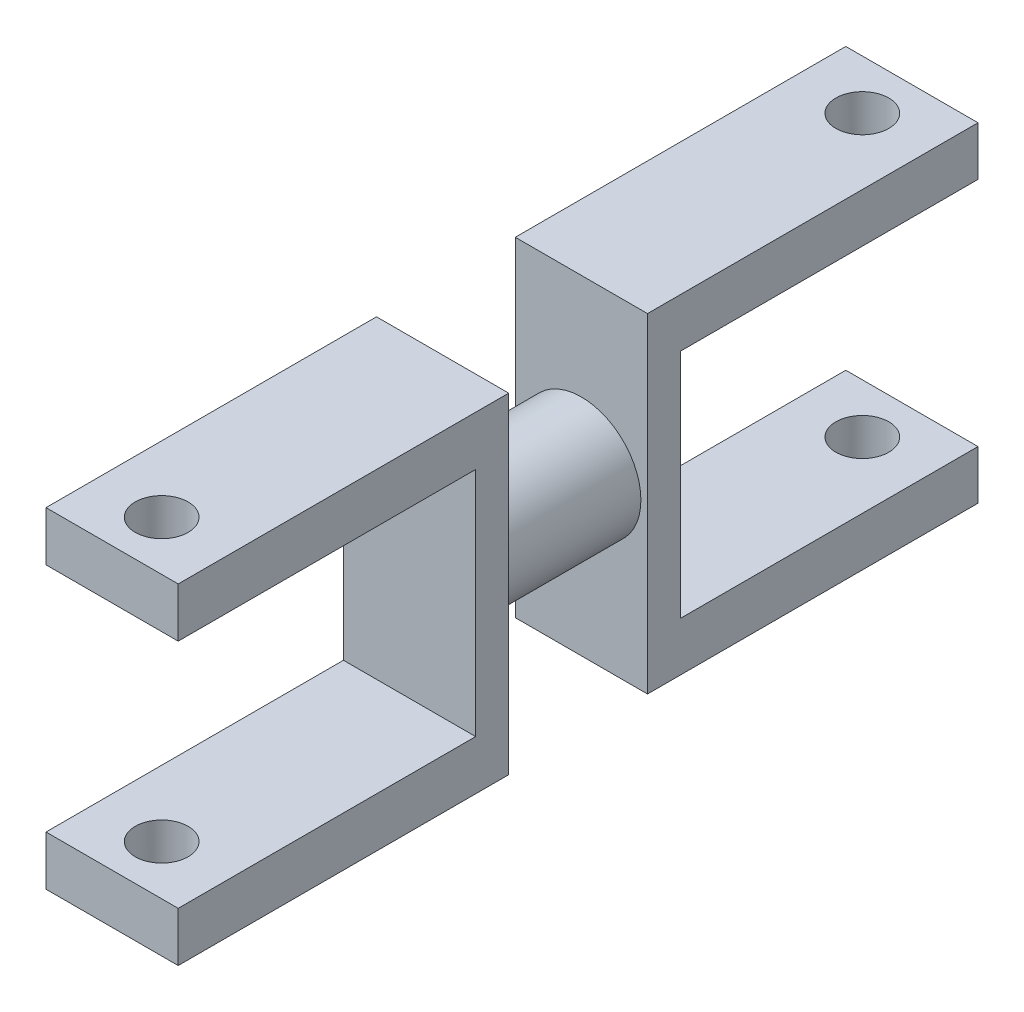
ISO-10303-21;
HEADER;
FILE_DESCRIPTION(('STEP AP214'),'2;1');
FILE_NAME('part.step','',(''),(''),'','','');
FILE_SCHEMA(('AUTOMOTIVE_DESIGN { 1 0 10303 214 1 1 1 1 }'));
ENDSEC;
DATA;
#1=APPLICATION_CONTEXT('core data for automotive mechanical design processes');
#2=APPLICATION_PROTOCOL_DEFINITION('international standard','automotive_design',2000,#1);
#3=PRODUCT_CONTEXT('',#1,'mechanical');
#4=PRODUCT('Part','Part','',(#3));
#5=PRODUCT_RELATED_PRODUCT_CATEGORY('part','',(#4));
#6=PRODUCT_DEFINITION_FORMATION('','',#4);
#7=PRODUCT_DEFINITION_CONTEXT('part definition',#1,'design');
#8=PRODUCT_DEFINITION('design','',#6,#7);
#9=PRODUCT_DEFINITION_SHAPE('','',#8);
#10=(LENGTH_UNIT() NAMED_UNIT(*) SI_UNIT(.MILLI.,.METRE.));
#11=(NAMED_UNIT(*) PLANE_ANGLE_UNIT() SI_UNIT($,.RADIAN.));
#12=(NAMED_UNIT(*) SI_UNIT($,.STERADIAN.) SOLID_ANGLE_UNIT());
#13=UNCERTAINTY_MEASURE_WITH_UNIT(LENGTH_MEASURE(1.E-05),#10,'distance_accuracy_value','');
#14=(GEOMETRIC_REPRESENTATION_CONTEXT(3) GLOBAL_UNCERTAINTY_ASSIGNED_CONTEXT((#13)) GLOBAL_UNIT_ASSIGNED_CONTEXT((#10,
#11,#12)) REPRESENTATION_CONTEXT('',''));
#15=CARTESIAN_POINT('',(0.,0.,0.));
#16=DIRECTION('',(0.,0.,1.));
#17=DIRECTION('',(1.,0.,0.));
#18=AXIS2_PLACEMENT_3D('',#15,#16,#17);
#19=CARTESIAN_POINT('',(4.,10.,28.4));
#20=DIRECTION('',(-1.,0.,0.));
#21=DIRECTION('',(0.,-1.,0.));
#22=AXIS2_PLACEMENT_3D('',#19,#20,#21);
#23=PLANE('',#22);
#24=DIRECTION('',(0.,0.,1.));
#25=VECTOR('',#24,1.);
#26=CARTESIAN_POINT('',(4.,7.,10.4));
#27=LINE('',#26,#25);
#28=CARTESIAN_POINT('',(4.,7.,10.4));
#29=VERTEX_POINT('',#28);
#30=CARTESIAN_POINT('',(4.,7.,28.4));
#31=VERTEX_POINT('',#30);
#32=EDGE_CURVE('E177',#29,#31,#27,.T.);
#33=ORIENTED_EDGE('',*,*,#32,.F.);
#34=DIRECTION('',(0.,1.,0.));
#35=VECTOR('',#34,1.);
#36=CARTESIAN_POINT('',(4.,0.,10.4));
#37=LINE('',#36,#35);
#38=CARTESIAN_POINT('',(4.,-7.,10.4));
#39=VERTEX_POINT('',#38);
#40=EDGE_CURVE('E161',#39,#29,#37,.T.);
#41=ORIENTED_EDGE('',*,*,#40,.F.);
#42=DIRECTION('',(0.,0.,1.));
#43=VECTOR('',#42,1.);
#44=CARTESIAN_POINT('',(4.,-7.,10.4));
#45=LINE('',#44,#43);
#46=CARTESIAN_POINT('',(4.,-7.,28.4));
#47=VERTEX_POINT('',#46);
#48=EDGE_CURVE('E157',#39,#47,#45,.T.);
#49=ORIENTED_EDGE('',*,*,#48,.T.);
#50=DIRECTION('',(0.,1.,0.));
#51=VECTOR('',#50,1.);
#52=CARTESIAN_POINT('',(4.,10.,28.4));
#53=LINE('',#52,#51);
#54=CARTESIAN_POINT('',(4.,-10.,28.4));
#55=VERTEX_POINT('',#54);
#56=EDGE_CURVE('E209',#55,#47,#53,.T.);
#57=ORIENTED_EDGE('',*,*,#56,.F.);
#58=DIRECTION('',(0.,0.,-1.));
#59=VECTOR('',#58,1.);
#60=CARTESIAN_POINT('',(4.,-10.,28.4));
#61=LINE('',#60,#59);
#62=CARTESIAN_POINT('',(4.,-10.,8.4));
#63=VERTEX_POINT('',#62);
#64=EDGE_CURVE('E220',#55,#63,#61,.T.);
#65=ORIENTED_EDGE('',*,*,#64,.T.);
#66=DIRECTION('',(0.,1.,0.));
#67=VECTOR('',#66,1.);
#68=CARTESIAN_POINT('',(4.,10.,8.4));
#69=LINE('',#68,#67);
#70=CARTESIAN_POINT('',(4.,10.,8.4));
#71=VERTEX_POINT('',#70);
#72=EDGE_CURVE('E202',#63,#71,#69,.T.);
#73=ORIENTED_EDGE('',*,*,#72,.T.);
#74=DIRECTION('',(0.,0.,-1.));
#75=VECTOR('',#74,1.);
#76=CARTESIAN_POINT('',(4.,10.,28.4));
#77=LINE('',#76,#75);
#78=CARTESIAN_POINT('',(4.,10.,28.4));
#79=VERTEX_POINT('',#78);
#80=EDGE_CURVE('E237',#79,#71,#77,.T.);
#81=ORIENTED_EDGE('',*,*,#80,.F.);
#82=EDGE_CURVE('E213',#31,#79,#53,.T.);
#83=ORIENTED_EDGE('',*,*,#82,.F.);
#84=EDGE_LOOP('',(#33,#41,#49,#57,#65,#73,#81,#83));
#85=FACE_BOUND('',#84,.T.);
#86=ADVANCED_FACE('F39',(#85),#23,.F.);
#87=CARTESIAN_POINT('',(-4.,10.,28.4));
#88=DIRECTION('',(1.,0.,0.));
#89=DIRECTION('',(0.,1.,0.));
#90=AXIS2_PLACEMENT_3D('',#87,#88,#89);
#91=PLANE('',#90);
#92=DIRECTION('',(0.,0.,1.));
#93=VECTOR('',#92,1.);
#94=CARTESIAN_POINT('',(-4.,7.,10.4));
#95=LINE('',#94,#93);
#96=CARTESIAN_POINT('',(-4.,7.,10.4));
#97=VERTEX_POINT('',#96);
#98=CARTESIAN_POINT('',(-4.,7.,28.4));
#99=VERTEX_POINT('',#98);
#100=EDGE_CURVE('E196',#97,#99,#95,.T.);
#101=ORIENTED_EDGE('',*,*,#100,.T.);
#102=DIRECTION('',(0.,-1.,0.));
#103=VECTOR('',#102,1.);
#104=CARTESIAN_POINT('',(-4.,10.,28.4));
#105=LINE('',#104,#103);
#106=CARTESIAN_POINT('',(-4.,10.,28.4));
#107=VERTEX_POINT('',#106);
#108=EDGE_CURVE('E215',#107,#99,#105,.T.);
#109=ORIENTED_EDGE('',*,*,#108,.F.);
#110=DIRECTION('',(0.,0.,-1.));
#111=VECTOR('',#110,1.);
#112=CARTESIAN_POINT('',(-4.,10.,28.4));
#113=LINE('',#112,#111);
#114=CARTESIAN_POINT('',(-4.,10.,8.4));
#115=VERTEX_POINT('',#114);
#116=EDGE_CURVE('E234',#107,#115,#113,.T.);
#117=ORIENTED_EDGE('',*,*,#116,.T.);
#118=DIRECTION('',(0.,-1.,0.));
#119=VECTOR('',#118,1.);
#120=CARTESIAN_POINT('',(-4.,10.,8.4));
#121=LINE('',#120,#119);
#122=CARTESIAN_POINT('',(-4.,-10.,8.4));
#123=VERTEX_POINT('',#122);
#124=EDGE_CURVE('E225',#115,#123,#121,.T.);
#125=ORIENTED_EDGE('',*,*,#124,.T.);
#126=DIRECTION('',(0.,0.,-1.));
#127=VECTOR('',#126,1.);
#128=CARTESIAN_POINT('',(-4.,-10.,28.4));
#129=LINE('',#128,#127);
#130=CARTESIAN_POINT('',(-4.,-10.,28.4));
#131=VERTEX_POINT('',#130);
#132=EDGE_CURVE('E231',#131,#123,#129,.T.);
#133=ORIENTED_EDGE('',*,*,#132,.F.);
#134=CARTESIAN_POINT('',(-4.,-7.,28.4));
#135=VERTEX_POINT('',#134);
#136=EDGE_CURVE('E175',#135,#131,#105,.T.);
#137=ORIENTED_EDGE('',*,*,#136,.F.);
#138=DIRECTION('',(0.,0.,1.));
#139=VECTOR('',#138,1.);
#140=CARTESIAN_POINT('',(-4.,-7.,10.4));
#141=LINE('',#140,#139);
#142=CARTESIAN_POINT('',(-4.,-7.,10.4));
#143=VERTEX_POINT('',#142);
#144=EDGE_CURVE('E57',#143,#135,#141,.T.);
#145=ORIENTED_EDGE('',*,*,#144,.F.);
#146=DIRECTION('',(0.,-1.,0.));
#147=VECTOR('',#146,1.);
#148=CARTESIAN_POINT('',(-4.,0.,10.4));
#149=LINE('',#148,#147);
#150=EDGE_CURVE('E162',#97,#143,#149,.T.);
#151=ORIENTED_EDGE('',*,*,#150,.F.);
#152=EDGE_LOOP('',(#101,#109,#117,#125,#133,#137,#145,#151));
#153=FACE_BOUND('',#152,.T.);
#154=ADVANCED_FACE('F173',(#153),#91,.F.);
#155=CARTESIAN_POINT('',(0.,0.,28.4));
#156=DIRECTION('',(0.,0.,1.));
#157=DIRECTION('',(1.,0.,0.));
#158=AXIS2_PLACEMENT_3D('',#155,#156,#157);
#159=PLANE('',#158);
#160=ORIENTED_EDGE('',*,*,#108,.T.);
#161=DIRECTION('',(1.,0.,0.));
#162=VECTOR('',#161,1.);
#163=CARTESIAN_POINT('',(0.,7.,28.4));
#164=LINE('',#163,#162);
#165=EDGE_CURVE('E170',#99,#31,#164,.T.);
#166=ORIENTED_EDGE('',*,*,#165,.T.);
#167=ORIENTED_EDGE('',*,*,#82,.T.);
#168=DIRECTION('',(-1.,0.,0.));
#169=VECTOR('',#168,1.);
#170=CARTESIAN_POINT('',(-4.,10.,28.4));
#171=LINE('',#170,#169);
#172=EDGE_CURVE('E212',#79,#107,#171,.T.);
#173=ORIENTED_EDGE('',*,*,#172,.T.);
#174=EDGE_LOOP('',(#160,#166,#167,#173));
#175=FACE_BOUND('',#174,.T.);
#176=ADVANCED_FACE('F318',(#175),#159,.T.);
#177=CARTESIAN_POINT('',(4.,9.96955040866876,-20.));
#178=DIRECTION('',(-1.,0.,0.));
#179=DIRECTION('',(0.,-1.,0.));
#180=AXIS2_PLACEMENT_3D('',#177,#178,#179);
#181=PLANE('',#180);
#182=DIRECTION('',(0.,0.,-1.));
#183=VECTOR('',#182,1.);
#184=CARTESIAN_POINT('',(4.,7.,-2.));
#185=LINE('',#184,#183);
#186=CARTESIAN_POINT('',(4.,7.,-2.));
#187=VERTEX_POINT('',#186);
#188=CARTESIAN_POINT('',(4.,7.,-20.));
#189=VERTEX_POINT('',#188);
#190=EDGE_CURVE('E199',#187,#189,#185,.T.);
#191=ORIENTED_EDGE('',*,*,#190,.T.);
#192=DIRECTION('',(0.,-1.,0.));
#193=VECTOR('',#192,1.);
#194=CARTESIAN_POINT('',(4.,9.96955040866876,-20.));
#195=LINE('',#194,#193);
#196=CARTESIAN_POINT('',(4.,9.96955040866876,-20.));
#197=VERTEX_POINT('',#196);
#198=EDGE_CURVE('E241',#197,#189,#195,.T.);
#199=ORIENTED_EDGE('',*,*,#198,.F.);
#200=DIRECTION('',(0.,0.,1.));
#201=VECTOR('',#200,1.);
#202=CARTESIAN_POINT('',(4.,9.96955040866876,-20.));
#203=LINE('',#202,#201);
#204=CARTESIAN_POINT('',(4.,9.96955040866876,0.));
#205=VERTEX_POINT('',#204);
#206=EDGE_CURVE('E255',#197,#205,#203,.T.);
#207=ORIENTED_EDGE('',*,*,#206,.T.);
#208=DIRECTION('',(0.,-1.,0.));
#209=VECTOR('',#208,1.);
#210=CARTESIAN_POINT('',(4.,9.96955040866876,0.));
#211=LINE('',#210,#209);
#212=CARTESIAN_POINT('',(4.,-9.96955040866876,0.));
#213=VERTEX_POINT('',#212);
#214=EDGE_CURVE('E256',#205,#213,#211,.T.);
#215=ORIENTED_EDGE('',*,*,#214,.T.);
#216=DIRECTION('',(0.,0.,1.));
#217=VECTOR('',#216,1.);
#218=CARTESIAN_POINT('',(4.,-9.96955040866876,-20.));
#219=LINE('',#218,#217);
#220=CARTESIAN_POINT('',(4.,-9.96955040866876,-20.));
#221=VERTEX_POINT('',#220);
#222=EDGE_CURVE('E273',#221,#213,#219,.T.);
#223=ORIENTED_EDGE('',*,*,#222,.F.);
#224=CARTESIAN_POINT('',(4.,-7.,-20.));
#225=VERTEX_POINT('',#224);
#226=EDGE_CURVE('E245',#225,#221,#195,.T.);
#227=ORIENTED_EDGE('',*,*,#226,.F.);
#228=DIRECTION('',(0.,0.,-1.));
#229=VECTOR('',#228,1.);
#230=CARTESIAN_POINT('',(4.,-7.,-2.));
#231=LINE('',#230,#229);
#232=CARTESIAN_POINT('',(4.,-7.,-2.));
#233=VERTEX_POINT('',#232);
#234=EDGE_CURVE('E65',#233,#225,#231,.T.);
#235=ORIENTED_EDGE('',*,*,#234,.F.);
#236=DIRECTION('',(0.,-1.,0.));
#237=VECTOR('',#236,1.);
#238=CARTESIAN_POINT('',(4.,0.,-2.));
#239=LINE('',#238,#237);
#240=EDGE_CURVE('E182',#187,#233,#239,.T.);
#241=ORIENTED_EDGE('',*,*,#240,.F.);
#242=EDGE_LOOP('',(#191,#199,#207,#215,#223,#227,#235,#241));
#243=FACE_BOUND('',#242,.T.);
#244=ADVANCED_FACE('F351',(#243),#181,.F.);
#245=CARTESIAN_POINT('',(-4.,9.96955040866876,-20.));
#246=DIRECTION('',(-1.,0.,0.));
#247=DIRECTION('',(0.,-1.,0.));
#248=AXIS2_PLACEMENT_3D('',#245,#246,#247);
#249=PLANE('',#248);
#250=DIRECTION('',(0.,-1.,0.));
#251=VECTOR('',#250,1.);
#252=CARTESIAN_POINT('',(-4.,9.96955040866876,-20.));
#253=LINE('',#252,#251);
#254=CARTESIAN_POINT('',(-4.,9.96955040866876,-20.));
#255=VERTEX_POINT('',#254);
#256=CARTESIAN_POINT('',(-4.,7.,-20.));
#257=VERTEX_POINT('',#256);
#258=EDGE_CURVE('E249',#255,#257,#253,.T.);
#259=ORIENTED_EDGE('',*,*,#258,.T.);
#260=DIRECTION('',(0.,0.,-1.));
#261=VECTOR('',#260,1.);
#262=CARTESIAN_POINT('',(-4.,7.,-2.));
#263=LINE('',#262,#261);
#264=CARTESIAN_POINT('',(-4.,7.,-2.));
#265=VERTEX_POINT('',#264);
#266=EDGE_CURVE('E203',#265,#257,#263,.T.);
#267=ORIENTED_EDGE('',*,*,#266,.F.);
#268=DIRECTION('',(0.,1.,0.));
#269=VECTOR('',#268,1.);
#270=CARTESIAN_POINT('',(-4.,0.,-2.));
#271=LINE('',#270,#269);
#272=CARTESIAN_POINT('',(-4.,-7.,-2.));
#273=VERTEX_POINT('',#272);
#274=EDGE_CURVE('E189',#273,#265,#271,.T.);
#275=ORIENTED_EDGE('',*,*,#274,.F.);
#276=DIRECTION('',(0.,0.,-1.));
#277=VECTOR('',#276,1.);
#278=CARTESIAN_POINT('',(-4.,-7.,-2.));
#279=LINE('',#278,#277);
#280=CARTESIAN_POINT('',(-4.,-7.,-20.));
#281=VERTEX_POINT('',#280);
#282=EDGE_CURVE('E205',#273,#281,#279,.T.);
#283=ORIENTED_EDGE('',*,*,#282,.T.);
#284=CARTESIAN_POINT('',(-4.,-9.96955040866876,-20.));
#285=VERTEX_POINT('',#284);
#286=EDGE_CURVE('E248',#281,#285,#253,.T.);
#287=ORIENTED_EDGE('',*,*,#286,.T.);
#288=DIRECTION('',(0.,0.,1.));
#289=VECTOR('',#288,1.);
#290=CARTESIAN_POINT('',(-4.,-9.96955040866876,-20.));
#291=LINE('',#290,#289);
#292=CARTESIAN_POINT('',(-4.,-9.96955040866876,0.));
#293=VERTEX_POINT('',#292);
#294=EDGE_CURVE('E271',#285,#293,#291,.T.);
#295=ORIENTED_EDGE('',*,*,#294,.T.);
#296=DIRECTION('',(0.,-1.,0.));
#297=VECTOR('',#296,1.);
#298=CARTESIAN_POINT('',(-4.,9.96955040866876,0.));
#299=LINE('',#298,#297);
#300=CARTESIAN_POINT('',(-4.,9.96955040866876,0.));
#301=VERTEX_POINT('',#300);
#302=EDGE_CURVE('E262',#301,#293,#299,.T.);
#303=ORIENTED_EDGE('',*,*,#302,.F.);
#304=DIRECTION('',(0.,0.,1.));
#305=VECTOR('',#304,1.);
#306=CARTESIAN_POINT('',(-4.,9.96955040866876,-20.));
#307=LINE('',#306,#305);
#308=EDGE_CURVE('E269',#255,#301,#307,.T.);
#309=ORIENTED_EDGE('',*,*,#308,.F.);
#310=EDGE_LOOP('',(#259,#267,#275,#283,#287,#295,#303,#309));
#311=FACE_BOUND('',#310,.T.);
#312=ADVANCED_FACE('F375',(#311),#249,.T.);
#313=CARTESIAN_POINT('',(0.,0.,-20.));
#314=DIRECTION('',(0.,0.,-1.));
#315=DIRECTION('',(-1.,0.,0.));
#316=AXIS2_PLACEMENT_3D('',#313,#314,#315);
#317=PLANE('',#316);
#318=ORIENTED_EDGE('',*,*,#198,.T.);
#319=DIRECTION('',(-1.,0.,0.));
#320=VECTOR('',#319,1.);
#321=CARTESIAN_POINT('',(0.,7.,-20.));
#322=LINE('',#321,#320);
#323=EDGE_CURVE('E186',#189,#257,#322,.T.);
#324=ORIENTED_EDGE('',*,*,#323,.T.);
#325=ORIENTED_EDGE('',*,*,#258,.F.);
#326=DIRECTION('',(-1.,0.,0.));
#327=VECTOR('',#326,1.);
#328=CARTESIAN_POINT('',(4.,9.96955040866876,-20.));
#329=LINE('',#328,#327);
#330=EDGE_CURVE('E252',#197,#255,#329,.T.);
#331=ORIENTED_EDGE('',*,*,#330,.F.);
#332=EDGE_LOOP('',(#318,#324,#325,#331));
#333=FACE_BOUND('',#332,.T.);
#334=ADVANCED_FACE('F366',(#333),#317,.T.);
#335=CARTESIAN_POINT('',(0.,0.,8.4));
#336=DIRECTION('',(0.,0.,-1.));
#337=DIRECTION('',(-1.,0.,0.));
#338=AXIS2_PLACEMENT_3D('',#335,#336,#337);
#339=CYLINDRICAL_SURFACE('',#338,3.6);
#340=CARTESIAN_POINT('',(0.,0.,8.4));
#341=DIRECTION('',(0.,0.,1.));
#342=DIRECTION('',(1.,0.,0.));
#343=AXIS2_PLACEMENT_3D('',#340,#341,#342);
#344=CIRCLE('',#343,3.6);
#345=CARTESIAN_POINT('',(3.6,0.,8.4));
#346=VERTEX_POINT('',#345);
#347=EDGE_CURVE('E11',#346,#346,#344,.T.);
#348=ORIENTED_EDGE('',*,*,#347,.F.);
#349=EDGE_LOOP('',(#348));
#350=FACE_BOUND('',#349,.T.);
#351=CARTESIAN_POINT('',(0.,0.,0.));
#352=DIRECTION('',(0.,0.,1.));
#353=DIRECTION('',(1.,0.,0.));
#354=AXIS2_PLACEMENT_3D('',#351,#352,#353);
#355=CIRCLE('',#354,3.6);
#356=CARTESIAN_POINT('',(3.6,0.,0.));
#357=VERTEX_POINT('',#356);
#358=EDGE_CURVE('E276',#357,#357,#355,.T.);
#359=ORIENTED_EDGE('',*,*,#358,.T.);
#360=EDGE_LOOP('',(#359));
#361=FACE_BOUND('',#360,.T.);
#362=ADVANCED_FACE('F41',(#350,#361),#339,.T.);
#363=CARTESIAN_POINT('',(4.,-9.96955040866876,-20.));
#364=DIRECTION('',(0.,1.,0.));
#365=DIRECTION('',(0.,0.,1.));
#366=AXIS2_PLACEMENT_3D('',#363,#364,#365);
#367=PLANE('',#366);
#368=CARTESIAN_POINT('',(0.,-9.96955040866876,-17.));
#369=DIRECTION('',(0.,1.,0.));
#370=DIRECTION('',(0.,0.,1.));
#371=AXIS2_PLACEMENT_3D('',#368,#369,#370);
#372=CIRCLE('',#371,1.6);
#373=CARTESIAN_POINT('',(0.,-9.96955040866876,-15.4));
#374=VERTEX_POINT('',#373);
#375=EDGE_CURVE('E304',#374,#374,#372,.F.);
#376=ORIENTED_EDGE('',*,*,#375,.F.);
#377=EDGE_LOOP('',(#376));
#378=FACE_BOUND('',#377,.T.);
#379=DIRECTION('',(-1.,0.,0.));
#380=VECTOR('',#379,1.);
#381=CARTESIAN_POINT('',(4.,-9.96955040866876,0.));
#382=LINE('',#381,#380);
#383=EDGE_CURVE('E259',#213,#293,#382,.T.);
#384=ORIENTED_EDGE('',*,*,#383,.T.);
#385=ORIENTED_EDGE('',*,*,#294,.F.);
#386=DIRECTION('',(-1.,0.,0.));
#387=VECTOR('',#386,1.);
#388=CARTESIAN_POINT('',(4.,-9.96955040866876,-20.));
#389=LINE('',#388,#387);
#390=EDGE_CURVE('E244',#221,#285,#389,.T.);
#391=ORIENTED_EDGE('',*,*,#390,.F.);
#392=ORIENTED_EDGE('',*,*,#222,.T.);
#393=EDGE_LOOP('',(#384,#385,#391,#392));
#394=FACE_BOUND('',#393,.T.);
#395=ADVANCED_FACE('F373',(#378,#394),#367,.F.);
#396=CARTESIAN_POINT('',(4.,9.96955040866876,-20.));
#397=DIRECTION('',(0.,1.,0.));
#398=DIRECTION('',(0.,0.,1.));
#399=AXIS2_PLACEMENT_3D('',#396,#397,#398);
#400=PLANE('',#399);
#401=CARTESIAN_POINT('',(0.,9.96955040866876,-17.));
#402=DIRECTION('',(0.,1.,0.));
#403=DIRECTION('',(0.,0.,1.));
#404=AXIS2_PLACEMENT_3D('',#401,#402,#403);
#405=CIRCLE('',#404,1.6);
#406=CARTESIAN_POINT('',(0.,9.96955040866876,-15.4));
#407=VERTEX_POINT('',#406);
#408=EDGE_CURVE('E301',#407,#407,#405,.F.);
#409=ORIENTED_EDGE('',*,*,#408,.T.);
#410=EDGE_LOOP('',(#409));
#411=FACE_BOUND('',#410,.T.);
#412=DIRECTION('',(-1.,0.,0.));
#413=VECTOR('',#412,1.);
#414=CARTESIAN_POINT('',(4.,9.96955040866876,0.));
#415=LINE('',#414,#413);
#416=EDGE_CURVE('E265',#205,#301,#415,.T.);
#417=ORIENTED_EDGE('',*,*,#416,.F.);
#418=ORIENTED_EDGE('',*,*,#206,.F.);
#419=ORIENTED_EDGE('',*,*,#330,.T.);
#420=ORIENTED_EDGE('',*,*,#308,.T.);
#421=EDGE_LOOP('',(#417,#418,#419,#420));
#422=FACE_BOUND('',#421,.T.);
#423=ADVANCED_FACE('F364',(#411,#422),#400,.T.);
#424=DIRECTION('',(-1.,0.,0.));
#425=VECTOR('',#424,1.);
#426=CARTESIAN_POINT('',(0.,-7.,-20.));
#427=LINE('',#426,#425);
#428=EDGE_CURVE('E194',#225,#281,#427,.T.);
#429=ORIENTED_EDGE('',*,*,#428,.F.);
#430=ORIENTED_EDGE('',*,*,#226,.T.);
#431=ORIENTED_EDGE('',*,*,#390,.T.);
#432=ORIENTED_EDGE('',*,*,#286,.F.);
#433=EDGE_LOOP('',(#429,#430,#431,#432));
#434=FACE_BOUND('',#433,.T.);
#435=ADVANCED_FACE('F360',(#434),#317,.T.);
#436=CARTESIAN_POINT('',(0.,0.,0.));
#437=DIRECTION('',(0.,0.,-1.));
#438=DIRECTION('',(-1.,0.,0.));
#439=AXIS2_PLACEMENT_3D('',#436,#437,#438);
#440=PLANE('',#439);
#441=ORIENTED_EDGE('',*,*,#358,.F.);
#442=EDGE_LOOP('',(#441));
#443=FACE_BOUND('',#442,.T.);
#444=ORIENTED_EDGE('',*,*,#214,.F.);
#445=ORIENTED_EDGE('',*,*,#416,.T.);
#446=ORIENTED_EDGE('',*,*,#302,.T.);
#447=ORIENTED_EDGE('',*,*,#383,.F.);
#448=EDGE_LOOP('',(#444,#445,#446,#447));
#449=FACE_BOUND('',#448,.T.);
#450=ADVANCED_FACE('F363',(#443,#449),#440,.F.);
#451=CARTESIAN_POINT('',(-4.,10.,28.4));
#452=DIRECTION('',(0.,-1.,0.));
#453=DIRECTION('',(0.,0.,-1.));
#454=AXIS2_PLACEMENT_3D('',#451,#452,#453);
#455=PLANE('',#454);
#456=CARTESIAN_POINT('',(0.,10.,25.4));
#457=DIRECTION('',(0.,-1.,0.));
#458=DIRECTION('',(0.,0.,-1.));
#459=AXIS2_PLACEMENT_3D('',#456,#457,#458);
#460=CIRCLE('',#459,1.6);
#461=CARTESIAN_POINT('',(0.,10.,23.8));
#462=VERTEX_POINT('',#461);
#463=EDGE_CURVE('E293',#462,#462,#460,.F.);
#464=ORIENTED_EDGE('',*,*,#463,.F.);
#465=EDGE_LOOP('',(#464));
#466=FACE_BOUND('',#465,.T.);
#467=DIRECTION('',(-1.,0.,0.));
#468=VECTOR('',#467,1.);
#469=CARTESIAN_POINT('',(-4.,10.,8.4));
#470=LINE('',#469,#468);
#471=EDGE_CURVE('E223',#71,#115,#470,.T.);
#472=ORIENTED_EDGE('',*,*,#471,.T.);
#473=ORIENTED_EDGE('',*,*,#116,.F.);
#474=ORIENTED_EDGE('',*,*,#172,.F.);
#475=ORIENTED_EDGE('',*,*,#80,.T.);
#476=EDGE_LOOP('',(#472,#473,#474,#475));
#477=FACE_BOUND('',#476,.T.);
#478=ADVANCED_FACE('F324',(#466,#477),#455,.F.);
#479=CARTESIAN_POINT('',(-4.,-10.,28.4));
#480=DIRECTION('',(0.,1.,0.));
#481=DIRECTION('',(0.,0.,1.));
#482=AXIS2_PLACEMENT_3D('',#479,#480,#481);
#483=PLANE('',#482);
#484=CARTESIAN_POINT('',(0.,-10.,25.4));
#485=DIRECTION('',(0.,1.,0.));
#486=DIRECTION('',(0.,0.,1.));
#487=AXIS2_PLACEMENT_3D('',#484,#485,#486);
#488=CIRCLE('',#487,1.6);
#489=CARTESIAN_POINT('',(0.,-10.,27.));
#490=VERTEX_POINT('',#489);
#491=EDGE_CURVE('E288',#490,#490,#488,.F.);
#492=ORIENTED_EDGE('',*,*,#491,.F.);
#493=EDGE_LOOP('',(#492));
#494=FACE_BOUND('',#493,.T.);
#495=DIRECTION('',(1.,0.,0.));
#496=VECTOR('',#495,1.);
#497=CARTESIAN_POINT('',(-4.,-10.,8.4));
#498=LINE('',#497,#496);
#499=EDGE_CURVE('E227',#123,#63,#498,.T.);
#500=ORIENTED_EDGE('',*,*,#499,.T.);
#501=ORIENTED_EDGE('',*,*,#64,.F.);
#502=DIRECTION('',(1.,0.,0.));
#503=VECTOR('',#502,1.);
#504=CARTESIAN_POINT('',(-4.,-10.,28.4));
#505=LINE('',#504,#503);
#506=EDGE_CURVE('E218',#131,#55,#505,.T.);
#507=ORIENTED_EDGE('',*,*,#506,.F.);
#508=ORIENTED_EDGE('',*,*,#132,.T.);
#509=EDGE_LOOP('',(#500,#501,#507,#508));
#510=FACE_BOUND('',#509,.T.);
#511=ADVANCED_FACE('F332',(#494,#510),#483,.F.);
#512=DIRECTION('',(1.,0.,0.));
#513=VECTOR('',#512,1.);
#514=CARTESIAN_POINT('',(0.,-7.,28.4));
#515=LINE('',#514,#513);
#516=EDGE_CURVE('E306',#135,#47,#515,.T.);
#517=ORIENTED_EDGE('',*,*,#516,.F.);
#518=ORIENTED_EDGE('',*,*,#136,.T.);
#519=ORIENTED_EDGE('',*,*,#506,.T.);
#520=ORIENTED_EDGE('',*,*,#56,.T.);
#521=EDGE_LOOP('',(#517,#518,#519,#520));
#522=FACE_BOUND('',#521,.T.);
#523=ADVANCED_FACE('F336',(#522),#159,.T.);
#524=CARTESIAN_POINT('',(0.,0.,8.4));
#525=DIRECTION('',(0.,0.,1.));
#526=DIRECTION('',(1.,0.,0.));
#527=AXIS2_PLACEMENT_3D('',#524,#525,#526);
#528=PLANE('',#527);
#529=ORIENTED_EDGE('',*,*,#347,.T.);
#530=EDGE_LOOP('',(#529));
#531=FACE_BOUND('',#530,.T.);
#532=ORIENTED_EDGE('',*,*,#72,.F.);
#533=ORIENTED_EDGE('',*,*,#499,.F.);
#534=ORIENTED_EDGE('',*,*,#124,.F.);
#535=ORIENTED_EDGE('',*,*,#471,.F.);
#536=EDGE_LOOP('',(#532,#533,#534,#535));
#537=FACE_BOUND('',#536,.T.);
#538=ADVANCED_FACE('F329',(#531,#537),#528,.F.);
#539=CARTESIAN_POINT('',(0.,7.,-2.));
#540=DIRECTION('',(0.,-1.,0.));
#541=DIRECTION('',(0.,0.,-1.));
#542=AXIS2_PLACEMENT_3D('',#539,#540,#541);
#543=PLANE('',#542);
#544=CARTESIAN_POINT('',(0.,7.,-17.));
#545=DIRECTION('',(0.,-1.,0.));
#546=DIRECTION('',(0.,0.,-1.));
#547=AXIS2_PLACEMENT_3D('',#544,#545,#546);
#548=CIRCLE('',#547,1.6);
#549=CARTESIAN_POINT('',(0.,7.,-18.6));
#550=VERTEX_POINT('',#549);
#551=EDGE_CURVE('E298',#550,#550,#548,.F.);
#552=ORIENTED_EDGE('',*,*,#551,.T.);
#553=EDGE_LOOP('',(#552));
#554=FACE_BOUND('',#553,.T.);
#555=ORIENTED_EDGE('',*,*,#323,.F.);
#556=ORIENTED_EDGE('',*,*,#190,.F.);
#557=DIRECTION('',(-1.,0.,0.));
#558=VECTOR('',#557,1.);
#559=CARTESIAN_POINT('',(0.,7.,-2.));
#560=LINE('',#559,#558);
#561=EDGE_CURVE('E192',#187,#265,#560,.T.);
#562=ORIENTED_EDGE('',*,*,#561,.T.);
#563=ORIENTED_EDGE('',*,*,#266,.T.);
#564=EDGE_LOOP('',(#555,#556,#562,#563));
#565=FACE_BOUND('',#564,.T.);
#566=ADVANCED_FACE('F343',(#554,#565),#543,.T.);
#567=CARTESIAN_POINT('',(0.,-7.,-2.));
#568=DIRECTION('',(0.,-1.,0.));
#569=DIRECTION('',(0.,0.,-1.));
#570=AXIS2_PLACEMENT_3D('',#567,#568,#569);
#571=PLANE('',#570);
#572=CARTESIAN_POINT('',(0.,-7.,-17.));
#573=DIRECTION('',(0.,-1.,0.));
#574=DIRECTION('',(0.,0.,-1.));
#575=AXIS2_PLACEMENT_3D('',#572,#573,#574);
#576=CIRCLE('',#575,1.6);
#577=CARTESIAN_POINT('',(0.,-7.,-18.6));
#578=VERTEX_POINT('',#577);
#579=EDGE_CURVE('E43',#578,#578,#576,.F.);
#580=ORIENTED_EDGE('',*,*,#579,.F.);
#581=EDGE_LOOP('',(#580));
#582=FACE_BOUND('',#581,.T.);
#583=ORIENTED_EDGE('',*,*,#428,.T.);
#584=ORIENTED_EDGE('',*,*,#282,.F.);
#585=DIRECTION('',(-1.,0.,0.));
#586=VECTOR('',#585,1.);
#587=CARTESIAN_POINT('',(0.,-7.,-2.));
#588=LINE('',#587,#586);
#589=EDGE_CURVE('E185',#233,#273,#588,.T.);
#590=ORIENTED_EDGE('',*,*,#589,.F.);
#591=ORIENTED_EDGE('',*,*,#234,.T.);
#592=EDGE_LOOP('',(#583,#584,#590,#591));
#593=FACE_BOUND('',#592,.T.);
#594=ADVANCED_FACE('F457',(#582,#593),#571,.F.);
#595=CARTESIAN_POINT('',(0.,0.,-2.));
#596=DIRECTION('',(0.,0.,-1.));
#597=DIRECTION('',(-1.,0.,0.));
#598=AXIS2_PLACEMENT_3D('',#595,#596,#597);
#599=PLANE('',#598);
#600=ORIENTED_EDGE('',*,*,#240,.T.);
#601=ORIENTED_EDGE('',*,*,#589,.T.);
#602=ORIENTED_EDGE('',*,*,#274,.T.);
#603=ORIENTED_EDGE('',*,*,#561,.F.);
#604=EDGE_LOOP('',(#600,#601,#602,#603));
#605=FACE_BOUND('',#604,.T.);
#606=ADVANCED_FACE('F449',(#605),#599,.T.);
#607=CARTESIAN_POINT('',(0.,7.,10.4));
#608=DIRECTION('',(0.,-1.,0.));
#609=DIRECTION('',(0.,0.,-1.));
#610=AXIS2_PLACEMENT_3D('',#607,#608,#609);
#611=PLANE('',#610);
#612=CARTESIAN_POINT('',(0.,7.,25.4));
#613=DIRECTION('',(0.,-1.,0.));
#614=DIRECTION('',(0.,0.,-1.));
#615=AXIS2_PLACEMENT_3D('',#612,#613,#614);
#616=CIRCLE('',#615,1.6);
#617=CARTESIAN_POINT('',(0.,7.,23.8));
#618=VERTEX_POINT('',#617);
#619=EDGE_CURVE('E284',#618,#618,#616,.F.);
#620=ORIENTED_EDGE('',*,*,#619,.T.);
#621=EDGE_LOOP('',(#620));
#622=FACE_BOUND('',#621,.T.);
#623=ORIENTED_EDGE('',*,*,#165,.F.);
#624=ORIENTED_EDGE('',*,*,#100,.F.);
#625=DIRECTION('',(1.,0.,0.));
#626=VECTOR('',#625,1.);
#627=CARTESIAN_POINT('',(0.,7.,10.4));
#628=LINE('',#627,#626);
#629=EDGE_CURVE('E167',#97,#29,#628,.T.);
#630=ORIENTED_EDGE('',*,*,#629,.T.);
#631=ORIENTED_EDGE('',*,*,#32,.T.);
#632=EDGE_LOOP('',(#623,#624,#630,#631));
#633=FACE_BOUND('',#632,.T.);
#634=ADVANCED_FACE('F314',(#622,#633),#611,.T.);
#635=CARTESIAN_POINT('',(0.,-7.,10.4));
#636=DIRECTION('',(0.,-1.,0.));
#637=DIRECTION('',(0.,0.,-1.));
#638=AXIS2_PLACEMENT_3D('',#635,#636,#637);
#639=PLANE('',#638);
#640=CARTESIAN_POINT('',(0.,-7.,25.4));
#641=DIRECTION('',(0.,-1.,0.));
#642=DIRECTION('',(0.,0.,-1.));
#643=AXIS2_PLACEMENT_3D('',#640,#641,#642);
#644=CIRCLE('',#643,1.6);
#645=CARTESIAN_POINT('',(0.,-7.,23.8));
#646=VERTEX_POINT('',#645);
#647=EDGE_CURVE('E282',#646,#646,#644,.F.);
#648=ORIENTED_EDGE('',*,*,#647,.F.);
#649=EDGE_LOOP('',(#648));
#650=FACE_BOUND('',#649,.T.);
#651=ORIENTED_EDGE('',*,*,#516,.T.);
#652=ORIENTED_EDGE('',*,*,#48,.F.);
#653=DIRECTION('',(1.,0.,0.));
#654=VECTOR('',#653,1.);
#655=CARTESIAN_POINT('',(0.,-7.,10.4));
#656=LINE('',#655,#654);
#657=EDGE_CURVE('E153',#143,#39,#656,.T.);
#658=ORIENTED_EDGE('',*,*,#657,.F.);
#659=ORIENTED_EDGE('',*,*,#144,.T.);
#660=EDGE_LOOP('',(#651,#652,#658,#659));
#661=FACE_BOUND('',#660,.T.);
#662=ADVANCED_FACE('F155',(#650,#661),#639,.F.);
#663=CARTESIAN_POINT('',(0.,0.,10.4));
#664=DIRECTION('',(0.,0.,1.));
#665=DIRECTION('',(1.,0.,0.));
#666=AXIS2_PLACEMENT_3D('',#663,#664,#665);
#667=PLANE('',#666);
#668=ORIENTED_EDGE('',*,*,#150,.T.);
#669=ORIENTED_EDGE('',*,*,#657,.T.);
#670=ORIENTED_EDGE('',*,*,#40,.T.);
#671=ORIENTED_EDGE('',*,*,#629,.F.);
#672=EDGE_LOOP('',(#668,#669,#670,#671));
#673=FACE_BOUND('',#672,.T.);
#674=ADVANCED_FACE('F166',(#673),#667,.T.);
#675=CARTESIAN_POINT('',(0.,19.9695504086688,25.4));
#676=DIRECTION('',(0.,-1.,0.));
#677=DIRECTION('',(0.,0.,-1.));
#678=AXIS2_PLACEMENT_3D('',#675,#676,#677);
#679=CYLINDRICAL_SURFACE('',#678,1.6);
#680=ORIENTED_EDGE('',*,*,#647,.T.);
#681=EDGE_LOOP('',(#680));
#682=FACE_BOUND('',#681,.T.);
#683=ORIENTED_EDGE('',*,*,#491,.T.);
#684=EDGE_LOOP('',(#683));
#685=FACE_BOUND('',#684,.T.);
#686=ADVANCED_FACE('F422',(#682,#685),#679,.F.);
#687=ORIENTED_EDGE('',*,*,#619,.F.);
#688=EDGE_LOOP('',(#687));
#689=FACE_BOUND('',#688,.T.);
#690=ORIENTED_EDGE('',*,*,#463,.T.);
#691=EDGE_LOOP('',(#690));
#692=FACE_BOUND('',#691,.T.);
#693=ADVANCED_FACE('F415',(#689,#692),#679,.F.);
#694=CARTESIAN_POINT('',(0.,19.9695504086688,-17.));
#695=DIRECTION('',(0.,-1.,0.));
#696=DIRECTION('',(0.,0.,-1.));
#697=AXIS2_PLACEMENT_3D('',#694,#695,#696);
#698=CYLINDRICAL_SURFACE('',#697,1.6);
#699=ORIENTED_EDGE('',*,*,#579,.T.);
#700=EDGE_LOOP('',(#699));
#701=FACE_BOUND('',#700,.T.);
#702=ORIENTED_EDGE('',*,*,#375,.T.);
#703=EDGE_LOOP('',(#702));
#704=FACE_BOUND('',#703,.T.);
#705=ADVANCED_FACE('F407',(#701,#704),#698,.F.);
#706=ORIENTED_EDGE('',*,*,#408,.F.);
#707=EDGE_LOOP('',(#706));
#708=FACE_BOUND('',#707,.T.);
#709=ORIENTED_EDGE('',*,*,#551,.F.);
#710=EDGE_LOOP('',(#709));
#711=FACE_BOUND('',#710,.T.);
#712=ADVANCED_FACE('F403',(#708,#711),#698,.F.);
#713=CLOSED_SHELL('',(#86,#154,#176,#244,#312,#334,#362,#395,#423,#435,#450,#478,#511,#523,#538,
#566,#594,#606,#634,#662,#674,#686,#693,#705,#712));
#714=CARTESIAN_POINT('',(0.,0.,0.));
#715=DIRECTION('',(0.,0.,1.));
#716=DIRECTION('',(1.,0.,0.));
#717=AXIS2_PLACEMENT_3D('',#714,#715,#716);
#718=CIRCLE('',#717,2.8);
#719=CARTESIAN_POINT('',(2.8,0.,0.));
#720=VERTEX_POINT('',#719);
#721=EDGE_CURVE('E49',#720,#720,#718,.T.);
#722=ORIENTED_EDGE('',*,*,#721,.T.);
#723=EDGE_LOOP('',(#722));
#724=FACE_BOUND('',#723,.T.);
#725=ADVANCED_FACE('F370',(#724),#440,.F.);
#726=CARTESIAN_POINT('',(0.,0.,8.4));
#727=DIRECTION('',(0.,0.,-1.));
#728=DIRECTION('',(-1.,0.,0.));
#729=AXIS2_PLACEMENT_3D('',#726,#727,#728);
#730=CYLINDRICAL_SURFACE('',#729,2.8);
#731=CARTESIAN_POINT('',(0.,0.,8.4));
#732=DIRECTION('',(0.,0.,1.));
#733=DIRECTION('',(1.,0.,0.));
#734=AXIS2_PLACEMENT_3D('',#731,#732,#733);
#735=CIRCLE('',#734,2.8);
#736=CARTESIAN_POINT('',(2.8,0.,8.4));
#737=VERTEX_POINT('',#736);
#738=EDGE_CURVE('E240',#737,#737,#735,.T.);
#739=ORIENTED_EDGE('',*,*,#738,.T.);
#740=EDGE_LOOP('',(#739));
#741=FACE_BOUND('',#740,.T.);
#742=ORIENTED_EDGE('',*,*,#721,.F.);
#743=EDGE_LOOP('',(#742));
#744=FACE_BOUND('',#743,.T.);
#745=ADVANCED_FACE('F384',(#741,#744),#730,.F.);
#746=ORIENTED_EDGE('',*,*,#738,.F.);
#747=EDGE_LOOP('',(#746));
#748=FACE_BOUND('',#747,.T.);
#749=ADVANCED_FACE('F346',(#748),#528,.F.);
#750=CLOSED_SHELL('',(#725,#745,#749));
#751=ORIENTED_CLOSED_SHELL('',*,#750,.T.);
#752=BREP_WITH_VOIDS('B2',#713,(#751));
#753=ADVANCED_BREP_SHAPE_REPRESENTATION('',(#18,#752),#14);
#754=SHAPE_DEFINITION_REPRESENTATION(#9,#753);
ENDSEC;
END-ISO-10303-21;
